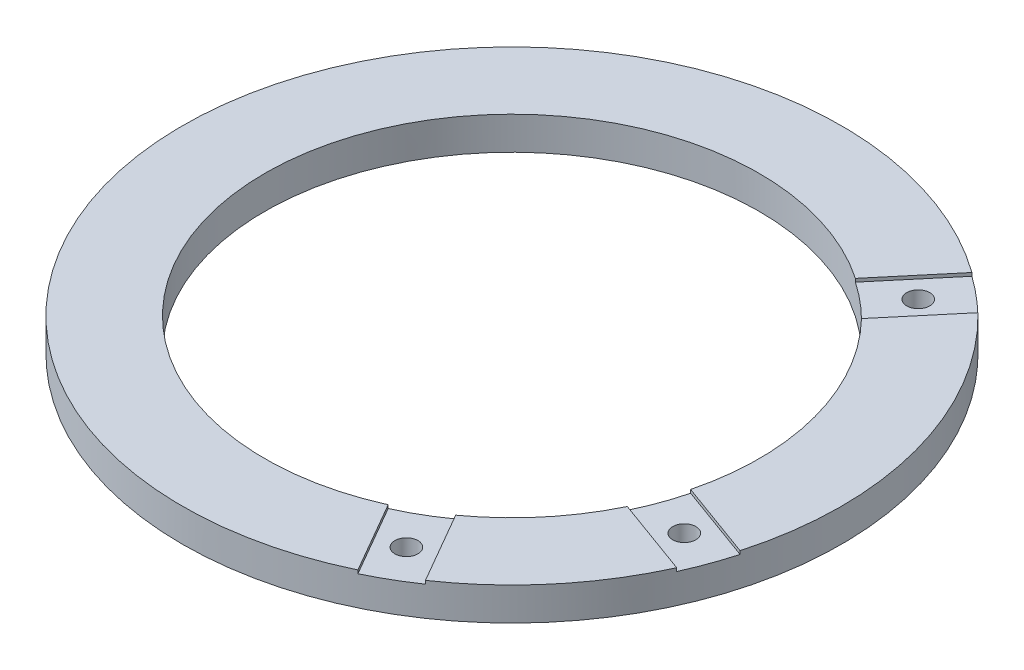
ISO-10303-21;
HEADER;
FILE_DESCRIPTION(('STEP AP214'),'2;1');
FILE_NAME('part.step','',(''),(''),'','','');
FILE_SCHEMA(('AUTOMOTIVE_DESIGN { 1 0 10303 214 1 1 1 1 }'));
ENDSEC;
DATA;
#1=APPLICATION_CONTEXT('core data for automotive mechanical design processes');
#2=APPLICATION_PROTOCOL_DEFINITION('international standard','automotive_design',2000,#1);
#3=PRODUCT_CONTEXT('',#1,'mechanical');
#4=PRODUCT('Part','Part','',(#3));
#5=PRODUCT_RELATED_PRODUCT_CATEGORY('part','',(#4));
#6=PRODUCT_DEFINITION_FORMATION('','',#4);
#7=PRODUCT_DEFINITION_CONTEXT('part definition',#1,'design');
#8=PRODUCT_DEFINITION('design','',#6,#7);
#9=PRODUCT_DEFINITION_SHAPE('','',#8);
#10=(LENGTH_UNIT() NAMED_UNIT(*) SI_UNIT(.MILLI.,.METRE.));
#11=(NAMED_UNIT(*) PLANE_ANGLE_UNIT() SI_UNIT($,.RADIAN.));
#12=(NAMED_UNIT(*) SI_UNIT($,.STERADIAN.) SOLID_ANGLE_UNIT());
#13=UNCERTAINTY_MEASURE_WITH_UNIT(LENGTH_MEASURE(1.E-05),#10,'distance_accuracy_value','');
#14=(GEOMETRIC_REPRESENTATION_CONTEXT(3) GLOBAL_UNCERTAINTY_ASSIGNED_CONTEXT((#13)) GLOBAL_UNIT_ASSIGNED_CONTEXT((#10,
#11,#12)) REPRESENTATION_CONTEXT('',''));
#15=CARTESIAN_POINT('',(0.,0.,0.));
#16=DIRECTION('',(0.,0.,1.));
#17=DIRECTION('',(1.,0.,0.));
#18=AXIS2_PLACEMENT_3D('',#15,#16,#17);
#19=CARTESIAN_POINT('',(0.,20.,0.));
#20=DIRECTION('',(0.,1.,0.));
#21=DIRECTION('',(0.,0.,1.));
#22=AXIS2_PLACEMENT_3D('',#19,#20,#21);
#23=PLANE('',#22);
#24=DIRECTION('',(-0.499999999999995,0.,-0.866025403784442));
#25=VECTOR('',#24,1.);
#26=CARTESIAN_POINT('',(12.9903810567666,20.,-7.49999999999991));
#27=LINE('',#26,#25);
#28=CARTESIAN_POINT('',(112.708734432661,20.,165.217254494159));
#29=VERTEX_POINT('',#28);
#30=CARTESIAN_POINT('',(87.6144388397623,20.,121.752659547106));
#31=VERTEX_POINT('',#30);
#32=EDGE_CURVE('E129',#29,#31,#27,.T.);
#33=ORIENTED_EDGE('',*,*,#32,.F.);
#34=CARTESIAN_POINT('',(0.,20.,0.));
#35=DIRECTION('',(0.,1.,0.));
#36=DIRECTION('',(0.,0.,1.));
#37=AXIS2_PLACEMENT_3D('',#34,#35,#36);
#38=CIRCLE('',#37,200.);
#39=CARTESIAN_POINT('',(182.278899498616,20.,82.3067603394364));
#40=VERTEX_POINT('',#39);
#41=EDGE_CURVE('E139',#29,#40,#38,.T.);
#42=ORIENTED_EDGE('',*,*,#41,.T.);
#43=DIRECTION('',(0.939692620785907,0.,0.342020143325673));
#44=VECTOR('',#43,1.);
#45=CARTESIAN_POINT('',(-5.13030214988508,20.,14.0953893117886));
#46=LINE('',#45,#44);
#47=CARTESIAN_POINT('',(135.117050713681,20.,65.1412511887561));
#48=VERTEX_POINT('',#47);
#49=EDGE_CURVE('E247',#48,#40,#46,.T.);
#50=ORIENTED_EDGE('',*,*,#49,.F.);
#51=CARTESIAN_POINT('',(0.,20.,0.));
#52=DIRECTION('',(0.,1.,0.));
#53=DIRECTION('',(0.,0.,1.));
#54=AXIS2_PLACEMENT_3D('',#51,#52,#53);
#55=CIRCLE('',#54,150.);
#56=EDGE_CURVE('E141',#31,#48,#55,.T.);
#57=ORIENTED_EDGE('',*,*,#56,.F.);
#58=EDGE_LOOP('',(#33,#42,#50,#57));
#59=FACE_BOUND('',#58,.T.);
#60=ADVANCED_FACE('F39',(#59),#23,.T.);
#61=DIRECTION('',(-0.939692620785907,0.,-0.342020143325673));
#62=VECTOR('',#61,1.);
#63=CARTESIAN_POINT('',(5.1303021498851,20.,-14.0953893117886));
#64=LINE('',#63,#62);
#65=CARTESIAN_POINT('',(192.539503798386,20.,54.1159817158593));
#66=VERTEX_POINT('',#65);
#67=CARTESIAN_POINT('',(145.377655013451,20.,36.950472565179));
#68=VERTEX_POINT('',#67);
#69=EDGE_CURVE('E249',#66,#68,#64,.T.);
#70=ORIENTED_EDGE('',*,*,#69,.F.);
#71=CARTESIAN_POINT('',(139.686110663524,20.,-143.135566815861));
#72=VERTEX_POINT('',#71);
#73=EDGE_CURVE('E149',#66,#72,#38,.T.);
#74=ORIENTED_EDGE('',*,*,#73,.T.);
#75=DIRECTION('',(0.64278760968654,0.,-0.766044443118977));
#76=VECTOR('',#75,1.);
#77=CARTESIAN_POINT('',(11.4906666467847,20.,9.6418141452981));
#78=LINE('',#77,#76);
#79=CARTESIAN_POINT('',(107.42550610167,20.,-104.68887543001));
#80=VERTEX_POINT('',#79);
#81=EDGE_CURVE('E228',#80,#72,#78,.T.);
#82=ORIENTED_EDGE('',*,*,#81,.F.);
#83=EDGE_CURVE('E206',#68,#80,#55,.T.);
#84=ORIENTED_EDGE('',*,*,#83,.F.);
#85=EDGE_LOOP('',(#70,#74,#82,#84));
#86=FACE_BOUND('',#85,.T.);
#87=ADVANCED_FACE('F272',(#86),#23,.T.);
#88=DIRECTION('',(0.499999999999995,0.,0.866025403784441));
#89=VECTOR('',#88,1.);
#90=CARTESIAN_POINT('',(-12.9903810567666,20.,7.49999999999992));
#91=LINE('',#90,#89);
#92=CARTESIAN_POINT('',(61.6336767262291,20.,136.752659547106));
#93=VERTEX_POINT('',#92);
#94=CARTESIAN_POINT('',(86.727972319128,20.,180.217254494159));
#95=VERTEX_POINT('',#94);
#96=EDGE_CURVE('E142',#93,#95,#91,.T.);
#97=ORIENTED_EDGE('',*,*,#96,.F.);
#98=CARTESIAN_POINT('',(84.4441728081006,20.,-123.972503720606));
#99=VERTEX_POINT('',#98);
#100=EDGE_CURVE('E160',#99,#93,#55,.T.);
#101=ORIENTED_EDGE('',*,*,#100,.F.);
#102=DIRECTION('',(-0.642787609686541,0.,0.766044443118977));
#103=VECTOR('',#102,1.);
#104=CARTESIAN_POINT('',(-11.4906666467846,20.,-9.64181414529811));
#105=LINE('',#104,#103);
#106=CARTESIAN_POINT('',(116.704777369955,20.,-162.419195106457));
#107=VERTEX_POINT('',#106);
#108=EDGE_CURVE('E232',#107,#99,#105,.T.);
#109=ORIENTED_EDGE('',*,*,#108,.F.);
#110=EDGE_CURVE('E148',#107,#95,#38,.T.);
#111=ORIENTED_EDGE('',*,*,#110,.T.);
#112=EDGE_LOOP('',(#97,#101,#109,#111));
#113=FACE_BOUND('',#112,.T.);
#114=ADVANCED_FACE('F198',(#113),#23,.T.);
#115=CARTESIAN_POINT('',(0.,0.,0.));
#116=DIRECTION('',(0.,1.,0.));
#117=DIRECTION('',(0.,0.,1.));
#118=AXIS2_PLACEMENT_3D('',#115,#116,#117);
#119=PLANE('',#118);
#120=CARTESIAN_POINT('',(87.4999999999991,0.,151.554445662277));
#121=DIRECTION('',(0.,1.,0.));
#122=DIRECTION('',(0.,0.,1.));
#123=AXIS2_PLACEMENT_3D('',#120,#121,#122);
#124=CIRCLE('',#123,6.99999999999999);
#125=CARTESIAN_POINT('',(87.4999999999991,0.,158.554445662277));
#126=VERTEX_POINT('',#125);
#127=EDGE_CURVE('E133',#126,#126,#124,.T.);
#128=ORIENTED_EDGE('',*,*,#127,.T.);
#129=EDGE_LOOP('',(#128));
#130=FACE_BOUND('',#129,.T.);
#131=CARTESIAN_POINT('',(164.446208637534,0.,59.8535250819928));
#132=DIRECTION('',(0.,1.,0.));
#133=DIRECTION('',(0.,0.,1.));
#134=AXIS2_PLACEMENT_3D('',#131,#132,#133);
#135=CIRCLE('',#134,7.00000000000001);
#136=CARTESIAN_POINT('',(164.446208637534,0.,66.8535250819928));
#137=VERTEX_POINT('',#136);
#138=EDGE_CURVE('E234',#137,#137,#135,.T.);
#139=ORIENTED_EDGE('',*,*,#138,.T.);
#140=EDGE_LOOP('',(#139));
#141=FACE_BOUND('',#140,.T.);
#142=CARTESIAN_POINT('',(112.487831695145,0.,-134.057777545821));
#143=DIRECTION('',(0.,1.,0.));
#144=DIRECTION('',(0.,0.,1.));
#145=AXIS2_PLACEMENT_3D('',#142,#143,#144);
#146=CIRCLE('',#145,6.99999999999999);
#147=CARTESIAN_POINT('',(112.487831695145,0.,-127.057777545821));
#148=VERTEX_POINT('',#147);
#149=EDGE_CURVE('E212',#148,#148,#146,.T.);
#150=ORIENTED_EDGE('',*,*,#149,.T.);
#151=EDGE_LOOP('',(#150));
#152=FACE_BOUND('',#151,.T.);
#153=CARTESIAN_POINT('',(0.,0.,0.));
#154=DIRECTION('',(0.,1.,0.));
#155=DIRECTION('',(0.,0.,1.));
#156=AXIS2_PLACEMENT_3D('',#153,#154,#155);
#157=CIRCLE('',#156,200.);
#158=CARTESIAN_POINT('',(0.,0.,200.));
#159=VERTEX_POINT('',#158);
#160=EDGE_CURVE('E153',#159,#159,#157,.T.);
#161=ORIENTED_EDGE('',*,*,#160,.F.);
#162=EDGE_LOOP('',(#161));
#163=FACE_BOUND('',#162,.T.);
#164=CARTESIAN_POINT('',(0.,0.,0.));
#165=DIRECTION('',(0.,1.,0.));
#166=DIRECTION('',(0.,0.,1.));
#167=AXIS2_PLACEMENT_3D('',#164,#165,#166);
#168=CIRCLE('',#167,150.);
#169=CARTESIAN_POINT('',(0.,0.,150.));
#170=VERTEX_POINT('',#169);
#171=EDGE_CURVE('E156',#170,#170,#168,.T.);
#172=ORIENTED_EDGE('',*,*,#171,.T.);
#173=EDGE_LOOP('',(#172));
#174=FACE_BOUND('',#173,.T.);
#175=ADVANCED_FACE('F300',(#130,#141,#152,#163,#174),#119,.F.);
#176=CARTESIAN_POINT('',(0.,20.,0.));
#177=DIRECTION('',(0.,-1.,0.));
#178=DIRECTION('',(0.,0.,-1.));
#179=AXIS2_PLACEMENT_3D('',#176,#177,#178);
#180=CYLINDRICAL_SURFACE('',#179,200.);
#181=ORIENTED_EDGE('',*,*,#41,.F.);
#182=DIRECTION('',(0.,-1.,0.));
#183=VECTOR('',#182,1.);
#184=CARTESIAN_POINT('',(112.708734432661,20.,165.217254494159));
#185=LINE('',#184,#183);
#186=CARTESIAN_POINT('',(112.708734432661,18.,165.217254494159));
#187=VERTEX_POINT('',#186);
#188=EDGE_CURVE('E126',#29,#187,#185,.T.);
#189=ORIENTED_EDGE('',*,*,#188,.T.);
#190=CARTESIAN_POINT('',(0.,18.,0.));
#191=DIRECTION('',(0.,-1.,0.));
#192=DIRECTION('',(0.,0.,-1.));
#193=AXIS2_PLACEMENT_3D('',#190,#191,#192);
#194=CIRCLE('',#193,200.);
#195=CARTESIAN_POINT('',(86.727972319128,18.,180.217254494159));
#196=VERTEX_POINT('',#195);
#197=EDGE_CURVE('E257',#187,#196,#194,.T.);
#198=ORIENTED_EDGE('',*,*,#197,.T.);
#199=DIRECTION('',(0.,-1.,0.));
#200=VECTOR('',#199,1.);
#201=CARTESIAN_POINT('',(86.727972319128,20.,180.217254494159));
#202=LINE('',#201,#200);
#203=EDGE_CURVE('E134',#196,#95,#202,.F.);
#204=ORIENTED_EDGE('',*,*,#203,.T.);
#205=ORIENTED_EDGE('',*,*,#110,.F.);
#206=DIRECTION('',(0.,-1.,0.));
#207=VECTOR('',#206,1.);
#208=CARTESIAN_POINT('',(116.704777369955,20.,-162.419195106457));
#209=LINE('',#208,#207);
#210=CARTESIAN_POINT('',(116.704777369955,18.,-162.419195106457));
#211=VERTEX_POINT('',#210);
#212=EDGE_CURVE('E216',#107,#211,#209,.T.);
#213=ORIENTED_EDGE('',*,*,#212,.T.);
#214=CARTESIAN_POINT('',(0.,18.,0.));
#215=DIRECTION('',(0.,-1.,0.));
#216=DIRECTION('',(0.,0.,-1.));
#217=AXIS2_PLACEMENT_3D('',#214,#215,#216);
#218=CIRCLE('',#217,200.);
#219=CARTESIAN_POINT('',(139.686110663524,18.,-143.135566815861));
#220=VERTEX_POINT('',#219);
#221=EDGE_CURVE('E225',#211,#220,#218,.T.);
#222=ORIENTED_EDGE('',*,*,#221,.T.);
#223=DIRECTION('',(0.,-1.,0.));
#224=VECTOR('',#223,1.);
#225=CARTESIAN_POINT('',(139.686110663524,20.,-143.135566815861));
#226=LINE('',#225,#224);
#227=EDGE_CURVE('E220',#220,#72,#226,.F.);
#228=ORIENTED_EDGE('',*,*,#227,.T.);
#229=ORIENTED_EDGE('',*,*,#73,.F.);
#230=DIRECTION('',(0.,-1.,0.));
#231=VECTOR('',#230,1.);
#232=CARTESIAN_POINT('',(192.539503798386,20.,54.1159817158593));
#233=LINE('',#232,#231);
#234=CARTESIAN_POINT('',(192.539503798386,18.,54.1159817158593));
#235=VERTEX_POINT('',#234);
#236=EDGE_CURVE('E240',#66,#235,#233,.T.);
#237=ORIENTED_EDGE('',*,*,#236,.T.);
#238=CARTESIAN_POINT('',(0.,18.,0.));
#239=DIRECTION('',(0.,-1.,0.));
#240=DIRECTION('',(0.,0.,-1.));
#241=AXIS2_PLACEMENT_3D('',#238,#239,#240);
#242=CIRCLE('',#241,200.);
#243=CARTESIAN_POINT('',(182.278899498616,18.,82.3067603394364));
#244=VERTEX_POINT('',#243);
#245=EDGE_CURVE('E244',#235,#244,#242,.T.);
#246=ORIENTED_EDGE('',*,*,#245,.T.);
#247=DIRECTION('',(0.,-1.,0.));
#248=VECTOR('',#247,1.);
#249=CARTESIAN_POINT('',(182.278899498616,20.,82.3067603394364));
#250=LINE('',#249,#248);
#251=EDGE_CURVE('E147',#244,#40,#250,.F.);
#252=ORIENTED_EDGE('',*,*,#251,.T.);
#253=EDGE_LOOP('',(#181,#189,#198,#204,#205,#213,#222,#228,#229,#237,#246,#252));
#254=FACE_BOUND('',#253,.T.);
#255=ORIENTED_EDGE('',*,*,#160,.T.);
#256=EDGE_LOOP('',(#255));
#257=FACE_BOUND('',#256,.T.);
#258=ADVANCED_FACE('F41',(#254,#257),#180,.T.);
#259=CARTESIAN_POINT('',(0.,20.,0.));
#260=DIRECTION('',(0.,-1.,0.));
#261=DIRECTION('',(0.,0.,-1.));
#262=AXIS2_PLACEMENT_3D('',#259,#260,#261);
#263=CYLINDRICAL_SURFACE('',#262,150.);
#264=DIRECTION('',(0.,-1.,0.));
#265=VECTOR('',#264,1.);
#266=CARTESIAN_POINT('',(87.6144388397623,20.,121.752659547106));
#267=LINE('',#266,#265);
#268=CARTESIAN_POINT('',(87.6144388397623,18.,121.752659547106));
#269=VERTEX_POINT('',#268);
#270=EDGE_CURVE('E11',#31,#269,#267,.T.);
#271=ORIENTED_EDGE('',*,*,#270,.F.);
#272=ORIENTED_EDGE('',*,*,#56,.T.);
#273=DIRECTION('',(0.,-1.,0.));
#274=VECTOR('',#273,1.);
#275=CARTESIAN_POINT('',(135.117050713681,20.,65.1412511887561));
#276=LINE('',#275,#274);
#277=CARTESIAN_POINT('',(135.117050713681,18.,65.1412511887561));
#278=VERTEX_POINT('',#277);
#279=EDGE_CURVE('E171',#278,#48,#276,.F.);
#280=ORIENTED_EDGE('',*,*,#279,.F.);
#281=CARTESIAN_POINT('',(0.,18.,0.));
#282=DIRECTION('',(0.,-1.,0.));
#283=DIRECTION('',(0.,0.,-1.));
#284=AXIS2_PLACEMENT_3D('',#281,#282,#283);
#285=CIRCLE('',#284,150.);
#286=CARTESIAN_POINT('',(145.377655013451,18.,36.950472565179));
#287=VERTEX_POINT('',#286);
#288=EDGE_CURVE('E175',#287,#278,#285,.T.);
#289=ORIENTED_EDGE('',*,*,#288,.F.);
#290=DIRECTION('',(0.,-1.,0.));
#291=VECTOR('',#290,1.);
#292=CARTESIAN_POINT('',(145.377655013451,20.,36.950472565179));
#293=LINE('',#292,#291);
#294=EDGE_CURVE('E179',#68,#287,#293,.T.);
#295=ORIENTED_EDGE('',*,*,#294,.F.);
#296=ORIENTED_EDGE('',*,*,#83,.T.);
#297=DIRECTION('',(0.,-1.,0.));
#298=VECTOR('',#297,1.);
#299=CARTESIAN_POINT('',(107.42550610167,20.,-104.68887543001));
#300=LINE('',#299,#298);
#301=CARTESIAN_POINT('',(107.42550610167,18.,-104.68887543001));
#302=VERTEX_POINT('',#301);
#303=EDGE_CURVE('E152',#302,#80,#300,.F.);
#304=ORIENTED_EDGE('',*,*,#303,.F.);
#305=CARTESIAN_POINT('',(0.,18.,0.));
#306=DIRECTION('',(0.,-1.,0.));
#307=DIRECTION('',(0.,0.,-1.));
#308=AXIS2_PLACEMENT_3D('',#305,#306,#307);
#309=CIRCLE('',#308,150.);
#310=CARTESIAN_POINT('',(84.4441728081006,18.,-123.972503720606));
#311=VERTEX_POINT('',#310);
#312=EDGE_CURVE('E164',#311,#302,#309,.T.);
#313=ORIENTED_EDGE('',*,*,#312,.F.);
#314=DIRECTION('',(0.,-1.,0.));
#315=VECTOR('',#314,1.);
#316=CARTESIAN_POINT('',(84.4441728081006,20.,-123.972503720606));
#317=LINE('',#316,#315);
#318=EDGE_CURVE('E168',#99,#311,#317,.T.);
#319=ORIENTED_EDGE('',*,*,#318,.F.);
#320=ORIENTED_EDGE('',*,*,#100,.T.);
#321=DIRECTION('',(0.,-1.,0.));
#322=VECTOR('',#321,1.);
#323=CARTESIAN_POINT('',(61.6336767262291,20.,136.752659547106));
#324=LINE('',#323,#322);
#325=CARTESIAN_POINT('',(61.6336767262291,18.,136.752659547106));
#326=VERTEX_POINT('',#325);
#327=EDGE_CURVE('E47',#326,#93,#324,.F.);
#328=ORIENTED_EDGE('',*,*,#327,.F.);
#329=CARTESIAN_POINT('',(0.,18.,0.));
#330=DIRECTION('',(0.,-1.,0.));
#331=DIRECTION('',(0.,0.,-1.));
#332=AXIS2_PLACEMENT_3D('',#329,#330,#331);
#333=CIRCLE('',#332,150.);
#334=EDGE_CURVE('E183',#269,#326,#333,.T.);
#335=ORIENTED_EDGE('',*,*,#334,.F.);
#336=EDGE_LOOP('',(#271,#272,#280,#289,#295,#296,#304,#313,#319,#320,#328,#335));
#337=FACE_BOUND('',#336,.T.);
#338=ORIENTED_EDGE('',*,*,#171,.F.);
#339=EDGE_LOOP('',(#338));
#340=FACE_BOUND('',#339,.T.);
#341=ADVANCED_FACE('F203',(#337,#340),#263,.F.);
#342=CARTESIAN_POINT('',(112.487831695145,20.,-134.057777545821));
#343=DIRECTION('',(0.,1.,0.));
#344=DIRECTION('',(0.,0.,1.));
#345=AXIS2_PLACEMENT_3D('',#342,#343,#344);
#346=CYLINDRICAL_SURFACE('',#345,6.99999999999999);
#347=CARTESIAN_POINT('',(112.487831695145,18.,-134.057777545821));
#348=DIRECTION('',(0.,-1.,0.));
#349=DIRECTION('',(0.,0.,-1.));
#350=AXIS2_PLACEMENT_3D('',#347,#348,#349);
#351=CIRCLE('',#350,6.99999999999999);
#352=CARTESIAN_POINT('',(112.487831695145,18.,-141.057777545821));
#353=VERTEX_POINT('',#352);
#354=EDGE_CURVE('E161',#353,#353,#351,.F.);
#355=ORIENTED_EDGE('',*,*,#354,.T.);
#356=EDGE_LOOP('',(#355));
#357=FACE_BOUND('',#356,.T.);
#358=ORIENTED_EDGE('',*,*,#149,.F.);
#359=EDGE_LOOP('',(#358));
#360=FACE_BOUND('',#359,.T.);
#361=ADVANCED_FACE('F284',(#357,#360),#346,.F.);
#362=CARTESIAN_POINT('',(-11.4906666467846,18.,-9.64181414529811));
#363=DIRECTION('',(-0.766044443118977,0.,-0.642787609686541));
#364=DIRECTION('',(-0.642787609686541,0.,0.766044443118977));
#365=AXIS2_PLACEMENT_3D('',#362,#363,#364);
#366=PLANE('',#365);
#367=ORIENTED_EDGE('',*,*,#108,.T.);
#368=ORIENTED_EDGE('',*,*,#318,.T.);
#369=DIRECTION('',(-0.642787609686541,0.,0.766044443118977));
#370=VECTOR('',#369,1.);
#371=CARTESIAN_POINT('',(-11.4906666467846,18.,-9.64181414529811));
#372=LINE('',#371,#370);
#373=EDGE_CURVE('E231',#211,#311,#372,.T.);
#374=ORIENTED_EDGE('',*,*,#373,.F.);
#375=ORIENTED_EDGE('',*,*,#212,.F.);
#376=EDGE_LOOP('',(#367,#368,#374,#375));
#377=FACE_BOUND('',#376,.T.);
#378=ADVANCED_FACE('F282',(#377),#366,.F.);
#379=CARTESIAN_POINT('',(11.4906666467847,18.,9.6418141452981));
#380=DIRECTION('',(0.766044443118977,0.,0.64278760968654));
#381=DIRECTION('',(0.64278760968654,0.,-0.766044443118977));
#382=AXIS2_PLACEMENT_3D('',#379,#380,#381);
#383=PLANE('',#382);
#384=DIRECTION('',(0.64278760968654,0.,-0.766044443118977));
#385=VECTOR('',#384,1.);
#386=CARTESIAN_POINT('',(11.4906666467847,18.,9.6418141452981));
#387=LINE('',#386,#385);
#388=EDGE_CURVE('E165',#302,#220,#387,.T.);
#389=ORIENTED_EDGE('',*,*,#388,.F.);
#390=ORIENTED_EDGE('',*,*,#303,.T.);
#391=ORIENTED_EDGE('',*,*,#81,.T.);
#392=ORIENTED_EDGE('',*,*,#227,.F.);
#393=EDGE_LOOP('',(#389,#390,#391,#392));
#394=FACE_BOUND('',#393,.T.);
#395=ADVANCED_FACE('F277',(#394),#383,.F.);
#396=CARTESIAN_POINT('',(0.,18.,0.));
#397=DIRECTION('',(0.,-1.,0.));
#398=DIRECTION('',(0.,0.,-1.));
#399=AXIS2_PLACEMENT_3D('',#396,#397,#398);
#400=PLANE('',#399);
#401=ORIENTED_EDGE('',*,*,#354,.F.);
#402=EDGE_LOOP('',(#401));
#403=FACE_BOUND('',#402,.T.);
#404=ORIENTED_EDGE('',*,*,#373,.T.);
#405=ORIENTED_EDGE('',*,*,#312,.T.);
#406=ORIENTED_EDGE('',*,*,#388,.T.);
#407=ORIENTED_EDGE('',*,*,#221,.F.);
#408=EDGE_LOOP('',(#404,#405,#406,#407));
#409=FACE_BOUND('',#408,.T.);
#410=ADVANCED_FACE('F280',(#403,#409),#400,.F.);
#411=CARTESIAN_POINT('',(164.446208637534,20.,59.8535250819928));
#412=DIRECTION('',(0.,1.,0.));
#413=DIRECTION('',(0.,0.,1.));
#414=AXIS2_PLACEMENT_3D('',#411,#412,#413);
#415=CYLINDRICAL_SURFACE('',#414,7.00000000000001);
#416=CARTESIAN_POINT('',(164.446208637534,18.,59.8535250819928));
#417=DIRECTION('',(0.,-1.,0.));
#418=DIRECTION('',(0.,0.,-1.));
#419=AXIS2_PLACEMENT_3D('',#416,#417,#418);
#420=CIRCLE('',#419,7.00000000000001);
#421=CARTESIAN_POINT('',(164.446208637534,18.,52.8535250819928));
#422=VERTEX_POINT('',#421);
#423=EDGE_CURVE('E172',#422,#422,#420,.F.);
#424=ORIENTED_EDGE('',*,*,#423,.T.);
#425=EDGE_LOOP('',(#424));
#426=FACE_BOUND('',#425,.T.);
#427=ORIENTED_EDGE('',*,*,#138,.F.);
#428=EDGE_LOOP('',(#427));
#429=FACE_BOUND('',#428,.T.);
#430=ADVANCED_FACE('F314',(#426,#429),#415,.F.);
#431=CARTESIAN_POINT('',(5.1303021498851,18.,-14.0953893117886));
#432=DIRECTION('',(0.342020143325673,0.,-0.939692620785907));
#433=DIRECTION('',(-0.939692620785907,0.,-0.342020143325673));
#434=AXIS2_PLACEMENT_3D('',#431,#432,#433);
#435=PLANE('',#434);
#436=ORIENTED_EDGE('',*,*,#69,.T.);
#437=ORIENTED_EDGE('',*,*,#294,.T.);
#438=DIRECTION('',(-0.939692620785907,0.,-0.342020143325673));
#439=VECTOR('',#438,1.);
#440=CARTESIAN_POINT('',(5.1303021498851,18.,-14.0953893117886));
#441=LINE('',#440,#439);
#442=EDGE_CURVE('E61',#235,#287,#441,.T.);
#443=ORIENTED_EDGE('',*,*,#442,.F.);
#444=ORIENTED_EDGE('',*,*,#236,.F.);
#445=EDGE_LOOP('',(#436,#437,#443,#444));
#446=FACE_BOUND('',#445,.T.);
#447=ADVANCED_FACE('F316',(#446),#435,.F.);
#448=CARTESIAN_POINT('',(-5.13030214988508,18.,14.0953893117886));
#449=DIRECTION('',(-0.342020143325673,0.,0.939692620785907));
#450=DIRECTION('',(0.939692620785907,0.,0.342020143325673));
#451=AXIS2_PLACEMENT_3D('',#448,#449,#450);
#452=PLANE('',#451);
#453=DIRECTION('',(0.939692620785907,0.,0.342020143325673));
#454=VECTOR('',#453,1.);
#455=CARTESIAN_POINT('',(-5.13030214988508,18.,14.0953893117886));
#456=LINE('',#455,#454);
#457=EDGE_CURVE('E176',#278,#244,#456,.T.);
#458=ORIENTED_EDGE('',*,*,#457,.F.);
#459=ORIENTED_EDGE('',*,*,#279,.T.);
#460=ORIENTED_EDGE('',*,*,#49,.T.);
#461=ORIENTED_EDGE('',*,*,#251,.F.);
#462=EDGE_LOOP('',(#458,#459,#460,#461));
#463=FACE_BOUND('',#462,.T.);
#464=ADVANCED_FACE('F266',(#463),#452,.F.);
#465=CARTESIAN_POINT('',(0.,18.,0.));
#466=DIRECTION('',(0.,-1.,0.));
#467=DIRECTION('',(0.939692620785909,0.,-0.342020143325666));
#468=AXIS2_PLACEMENT_3D('',#465,#466,#467);
#469=PLANE('',#468);
#470=ORIENTED_EDGE('',*,*,#423,.F.);
#471=EDGE_LOOP('',(#470));
#472=FACE_BOUND('',#471,.T.);
#473=ORIENTED_EDGE('',*,*,#442,.T.);
#474=ORIENTED_EDGE('',*,*,#288,.T.);
#475=ORIENTED_EDGE('',*,*,#457,.T.);
#476=ORIENTED_EDGE('',*,*,#245,.F.);
#477=EDGE_LOOP('',(#473,#474,#475,#476));
#478=FACE_BOUND('',#477,.T.);
#479=ADVANCED_FACE('F267',(#472,#478),#469,.F.);
#480=CARTESIAN_POINT('',(87.4999999999991,20.,151.554445662277));
#481=DIRECTION('',(0.,1.,0.));
#482=DIRECTION('',(0.,0.,1.));
#483=AXIS2_PLACEMENT_3D('',#480,#481,#482);
#484=CYLINDRICAL_SURFACE('',#483,6.99999999999999);
#485=CARTESIAN_POINT('',(87.4999999999991,18.,151.554445662277));
#486=DIRECTION('',(0.,-1.,0.));
#487=DIRECTION('',(0.,0.,-1.));
#488=AXIS2_PLACEMENT_3D('',#485,#486,#487);
#489=CIRCLE('',#488,6.99999999999999);
#490=CARTESIAN_POINT('',(87.4999999999991,18.,144.554445662277));
#491=VERTEX_POINT('',#490);
#492=EDGE_CURVE('E181',#491,#491,#489,.F.);
#493=ORIENTED_EDGE('',*,*,#492,.T.);
#494=EDGE_LOOP('',(#493));
#495=FACE_BOUND('',#494,.T.);
#496=ORIENTED_EDGE('',*,*,#127,.F.);
#497=EDGE_LOOP('',(#496));
#498=FACE_BOUND('',#497,.T.);
#499=ADVANCED_FACE('F331',(#495,#498),#484,.F.);
#500=CARTESIAN_POINT('',(12.9903810567666,18.,-7.49999999999991));
#501=DIRECTION('',(0.866025403784442,0.,-0.499999999999995));
#502=DIRECTION('',(-0.499999999999995,0.,-0.866025403784442));
#503=AXIS2_PLACEMENT_3D('',#500,#501,#502);
#504=PLANE('',#503);
#505=ORIENTED_EDGE('',*,*,#32,.T.);
#506=ORIENTED_EDGE('',*,*,#270,.T.);
#507=DIRECTION('',(-0.499999999999995,0.,-0.866025403784442));
#508=VECTOR('',#507,1.);
#509=CARTESIAN_POINT('',(12.9903810567666,18.,-7.49999999999991));
#510=LINE('',#509,#508);
#511=EDGE_CURVE('E54',#187,#269,#510,.T.);
#512=ORIENTED_EDGE('',*,*,#511,.F.);
#513=ORIENTED_EDGE('',*,*,#188,.F.);
#514=EDGE_LOOP('',(#505,#506,#512,#513));
#515=FACE_BOUND('',#514,.T.);
#516=ADVANCED_FACE('F128',(#515),#504,.F.);
#517=CARTESIAN_POINT('',(-12.9903810567666,18.,7.49999999999992));
#518=DIRECTION('',(-0.866025403784441,0.,0.499999999999995));
#519=DIRECTION('',(0.499999999999995,0.,0.866025403784441));
#520=AXIS2_PLACEMENT_3D('',#517,#518,#519);
#521=PLANE('',#520);
#522=DIRECTION('',(0.499999999999995,0.,0.866025403784441));
#523=VECTOR('',#522,1.);
#524=CARTESIAN_POINT('',(-12.9903810567666,18.,7.49999999999992));
#525=LINE('',#524,#523);
#526=EDGE_CURVE('E184',#326,#196,#525,.T.);
#527=ORIENTED_EDGE('',*,*,#526,.F.);
#528=ORIENTED_EDGE('',*,*,#327,.T.);
#529=ORIENTED_EDGE('',*,*,#96,.T.);
#530=ORIENTED_EDGE('',*,*,#203,.F.);
#531=EDGE_LOOP('',(#527,#528,#529,#530));
#532=FACE_BOUND('',#531,.T.);
#533=ADVANCED_FACE('F189',(#532),#521,.F.);
#534=CARTESIAN_POINT('',(0.,18.,0.));
#535=DIRECTION('',(0.,-1.,0.));
#536=DIRECTION('',(0.939692620785907,0.,0.342020143325673));
#537=AXIS2_PLACEMENT_3D('',#534,#535,#536);
#538=PLANE('',#537);
#539=ORIENTED_EDGE('',*,*,#492,.F.);
#540=EDGE_LOOP('',(#539));
#541=FACE_BOUND('',#540,.T.);
#542=ORIENTED_EDGE('',*,*,#511,.T.);
#543=ORIENTED_EDGE('',*,*,#334,.T.);
#544=ORIENTED_EDGE('',*,*,#526,.T.);
#545=ORIENTED_EDGE('',*,*,#197,.F.);
#546=EDGE_LOOP('',(#542,#543,#544,#545));
#547=FACE_BOUND('',#546,.T.);
#548=ADVANCED_FACE('F261',(#541,#547),#538,.F.);
#549=CLOSED_SHELL('',(#60,#87,#114,#175,#258,#341,#361,#378,#395,#410,#430,#447,#464,#479,#499,
#516,#533,#548));
#550=MANIFOLD_SOLID_BREP('B2',#549);
#551=ADVANCED_BREP_SHAPE_REPRESENTATION('',(#18,#550),#14);
#552=SHAPE_DEFINITION_REPRESENTATION(#9,#551);
ENDSEC;
END-ISO-10303-21;
